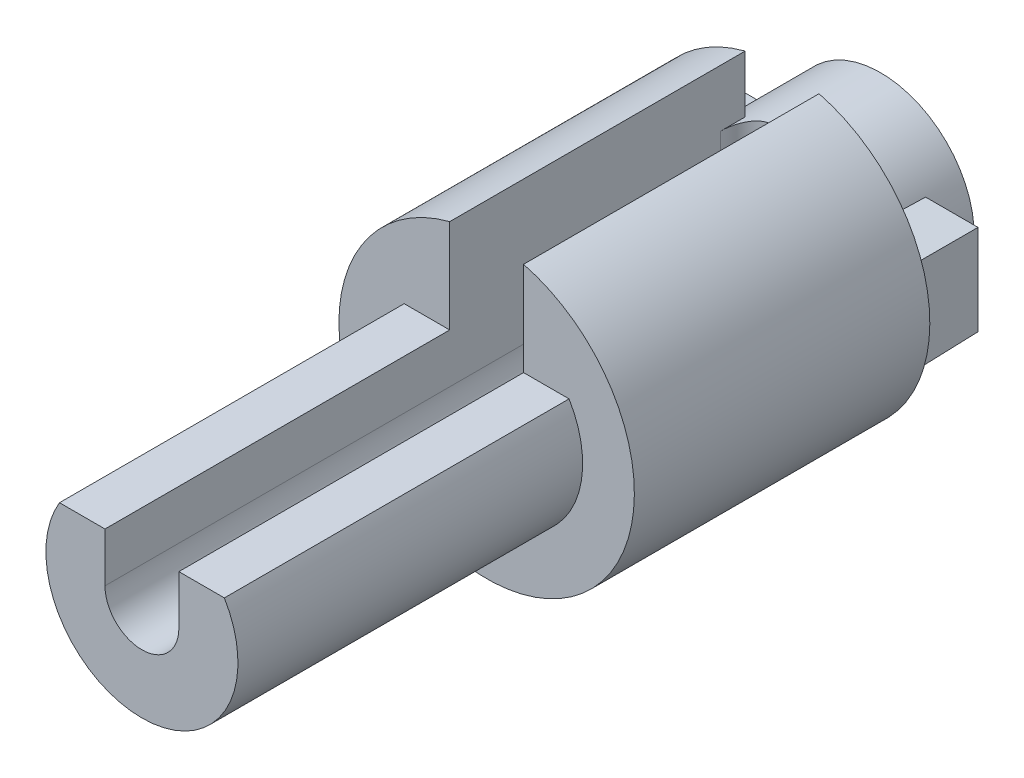
ISO-10303-21;
HEADER;
FILE_DESCRIPTION(('STEP AP214'),'2;1');
FILE_NAME('part.step','',(''),(''),'','','');
FILE_SCHEMA(('AUTOMOTIVE_DESIGN { 1 0 10303 214 1 1 1 1 }'));
ENDSEC;
DATA;
#1=APPLICATION_CONTEXT('core data for automotive mechanical design processes');
#2=APPLICATION_PROTOCOL_DEFINITION('international standard','automotive_design',2000,#1);
#3=PRODUCT_CONTEXT('',#1,'mechanical');
#4=PRODUCT('Part','Part','',(#3));
#5=PRODUCT_RELATED_PRODUCT_CATEGORY('part','',(#4));
#6=PRODUCT_DEFINITION_FORMATION('','',#4);
#7=PRODUCT_DEFINITION_CONTEXT('part definition',#1,'design');
#8=PRODUCT_DEFINITION('design','',#6,#7);
#9=PRODUCT_DEFINITION_SHAPE('','',#8);
#10=(LENGTH_UNIT() NAMED_UNIT(*) SI_UNIT(.MILLI.,.METRE.));
#11=(NAMED_UNIT(*) PLANE_ANGLE_UNIT() SI_UNIT($,.RADIAN.));
#12=(NAMED_UNIT(*) SI_UNIT($,.STERADIAN.) SOLID_ANGLE_UNIT());
#13=UNCERTAINTY_MEASURE_WITH_UNIT(LENGTH_MEASURE(1.E-05),#10,'distance_accuracy_value','');
#14=(GEOMETRIC_REPRESENTATION_CONTEXT(3) GLOBAL_UNCERTAINTY_ASSIGNED_CONTEXT((#13)) GLOBAL_UNIT_ASSIGNED_CONTEXT((#10,
#11,#12)) REPRESENTATION_CONTEXT('',''));
#15=CARTESIAN_POINT('',(0.,0.,0.));
#16=DIRECTION('',(0.,0.,1.));
#17=DIRECTION('',(1.,0.,0.));
#18=AXIS2_PLACEMENT_3D('',#15,#16,#17);
#19=CARTESIAN_POINT('',(-8.49971958286482,10.862396022545,0.));
#20=DIRECTION('',(0.,0.,1.));
#21=DIRECTION('',(1.,0.,0.));
#22=AXIS2_PLACEMENT_3D('',#19,#20,#21);
#23=PLANE('',#22);
#24=CARTESIAN_POINT('',(0.,0.,0.));
#25=DIRECTION('',(0.,0.,-1.));
#26=DIRECTION('',(-1.,0.,0.));
#27=AXIS2_PLACEMENT_3D('',#24,#25,#26);
#28=CIRCLE('',#27,3.);
#29=CARTESIAN_POINT('',(0.75,2.90473750965557,0.));
#30=VERTEX_POINT('',#29);
#31=CARTESIAN_POINT('',(-0.749999999999993,2.90473750965557,0.));
#32=VERTEX_POINT('',#31);
#33=EDGE_CURVE('E217',#30,#32,#28,.T.);
#34=ORIENTED_EDGE('',*,*,#33,.T.);
#35=DIRECTION('',(0.,1.,0.));
#36=VECTOR('',#35,1.);
#37=CARTESIAN_POINT('',(-0.750000000000003,0.,0.));
#38=LINE('',#37,#36);
#39=CARTESIAN_POINT('',(-0.749999999999997,1.74570902500961,0.));
#40=VERTEX_POINT('',#39);
#41=EDGE_CURVE('E278',#40,#32,#38,.T.);
#42=ORIENTED_EDGE('',*,*,#41,.F.);
#43=CARTESIAN_POINT('',(0.,0.,0.));
#44=DIRECTION('',(0.,0.,-1.));
#45=DIRECTION('',(-1.,0.,0.));
#46=AXIS2_PLACEMENT_3D('',#43,#44,#45);
#47=CIRCLE('',#46,1.9);
#48=CARTESIAN_POINT('',(-1.65118139524402,0.940000000000002,0.));
#49=VERTEX_POINT('',#48);
#50=EDGE_CURVE('E230',#49,#40,#47,.T.);
#51=ORIENTED_EDGE('',*,*,#50,.F.);
#52=DIRECTION('',(1.,0.,0.));
#53=VECTOR('',#52,1.);
#54=CARTESIAN_POINT('',(2.75,0.940000000000002,0.));
#55=LINE('',#54,#53);
#56=CARTESIAN_POINT('',(-2.75,0.940000000000002,0.));
#57=VERTEX_POINT('',#56);
#58=EDGE_CURVE('E242',#57,#49,#55,.T.);
#59=ORIENTED_EDGE('',*,*,#58,.F.);
#60=DIRECTION('',(0.,1.,0.));
#61=VECTOR('',#60,1.);
#62=CARTESIAN_POINT('',(-2.75,0.940000000000002,0.));
#63=LINE('',#62,#61);
#64=CARTESIAN_POINT('',(-2.75,-0.939999999999998,0.));
#65=VERTEX_POINT('',#64);
#66=EDGE_CURVE('E239',#65,#57,#63,.T.);
#67=ORIENTED_EDGE('',*,*,#66,.F.);
#68=DIRECTION('',(-1.,0.,0.));
#69=VECTOR('',#68,1.);
#70=CARTESIAN_POINT('',(2.75,-0.939999999999998,0.));
#71=LINE('',#70,#69);
#72=CARTESIAN_POINT('',(-1.65118139524402,-0.939999999999998,0.));
#73=VERTEX_POINT('',#72);
#74=EDGE_CURVE('E248',#73,#65,#71,.T.);
#75=ORIENTED_EDGE('',*,*,#74,.F.);
#76=CARTESIAN_POINT('',(1.65118139524402,-0.939999999999998,0.));
#77=VERTEX_POINT('',#76);
#78=EDGE_CURVE('E225',#77,#73,#47,.T.);
#79=ORIENTED_EDGE('',*,*,#78,.F.);
#80=CARTESIAN_POINT('',(2.75,-0.939999999999998,0.));
#81=VERTEX_POINT('',#80);
#82=EDGE_CURVE('E249',#81,#77,#71,.T.);
#83=ORIENTED_EDGE('',*,*,#82,.F.);
#84=DIRECTION('',(0.,-1.,0.));
#85=VECTOR('',#84,1.);
#86=CARTESIAN_POINT('',(2.75,0.940000000000002,0.));
#87=LINE('',#86,#85);
#88=CARTESIAN_POINT('',(2.75,0.940000000000002,0.));
#89=VERTEX_POINT('',#88);
#90=EDGE_CURVE('E245',#89,#81,#87,.T.);
#91=ORIENTED_EDGE('',*,*,#90,.F.);
#92=CARTESIAN_POINT('',(1.65118139524402,0.940000000000002,0.));
#93=VERTEX_POINT('',#92);
#94=EDGE_CURVE('E190',#93,#89,#55,.T.);
#95=ORIENTED_EDGE('',*,*,#94,.F.);
#96=CARTESIAN_POINT('',(0.749999999999997,1.74570902500961,0.));
#97=VERTEX_POINT('',#96);
#98=EDGE_CURVE('E233',#97,#93,#47,.T.);
#99=ORIENTED_EDGE('',*,*,#98,.F.);
#100=DIRECTION('',(0.,-1.,0.));
#101=VECTOR('',#100,1.);
#102=CARTESIAN_POINT('',(0.75,0.,0.));
#103=LINE('',#102,#101);
#104=EDGE_CURVE('E281',#30,#97,#103,.T.);
#105=ORIENTED_EDGE('',*,*,#104,.F.);
#106=EDGE_LOOP('',(#34,#42,#51,#59,#67,#75,#79,#83,#91,#95,#99,#105));
#107=FACE_BOUND('',#106,.T.);
#108=ADVANCED_FACE('F41',(#107),#23,.F.);
#109=CARTESIAN_POINT('',(-0.750000000000003,0.,11.));
#110=DIRECTION('',(-1.,0.,0.));
#111=DIRECTION('',(0.,-1.,0.));
#112=AXIS2_PLACEMENT_3D('',#109,#110,#111);
#113=PLANE('',#112);
#114=DIRECTION('',(0.,0.,-1.));
#115=VECTOR('',#114,1.);
#116=CARTESIAN_POINT('',(-0.750000000000003,0.,11.));
#117=LINE('',#116,#115);
#118=CARTESIAN_POINT('',(-0.750000000000004,0.,13.));
#119=VERTEX_POINT('',#118);
#120=CARTESIAN_POINT('',(-0.750000000000003,0.,0.5));
#121=VERTEX_POINT('',#120);
#122=EDGE_CURVE('E297',#119,#121,#117,.T.);
#123=ORIENTED_EDGE('',*,*,#122,.T.);
#124=DIRECTION('',(0.,1.,0.));
#125=VECTOR('',#124,1.);
#126=CARTESIAN_POINT('',(-0.749999999999997,1.74570902500961,0.5));
#127=LINE('',#126,#125);
#128=CARTESIAN_POINT('',(-0.749999999999997,1.74570902500961,0.5));
#129=VERTEX_POINT('',#128);
#130=EDGE_CURVE('E321',#121,#129,#127,.T.);
#131=ORIENTED_EDGE('',*,*,#130,.T.);
#132=DIRECTION('',(0.,0.,1.));
#133=VECTOR('',#132,1.);
#134=CARTESIAN_POINT('',(-0.749999999999997,1.74570902500961,0.5));
#135=LINE('',#134,#133);
#136=EDGE_CURVE('E65',#129,#40,#135,.F.);
#137=ORIENTED_EDGE('',*,*,#136,.T.);
#138=ORIENTED_EDGE('',*,*,#41,.T.);
#139=DIRECTION('',(0.,0.,-1.));
#140=VECTOR('',#139,1.);
#141=CARTESIAN_POINT('',(-0.749999999999993,2.90473750965557,25.));
#142=LINE('',#141,#140);
#143=CARTESIAN_POINT('',(-0.750000000000002,2.90473750965556,6.));
#144=VERTEX_POINT('',#143);
#145=EDGE_CURVE('E223',#144,#32,#142,.T.);
#146=ORIENTED_EDGE('',*,*,#145,.F.);
#147=DIRECTION('',(0.,-1.,0.));
#148=VECTOR('',#147,1.);
#149=CARTESIAN_POINT('',(-0.750000000000003,0.,6.));
#150=LINE('',#149,#148);
#151=CARTESIAN_POINT('',(-0.750000000000003,1.,6.));
#152=VERTEX_POINT('',#151);
#153=EDGE_CURVE('E282',#144,#152,#150,.T.);
#154=ORIENTED_EDGE('',*,*,#153,.T.);
#155=DIRECTION('',(0.,0.,-1.));
#156=VECTOR('',#155,1.);
#157=CARTESIAN_POINT('',(-0.749999999999999,1.,11.));
#158=LINE('',#157,#156);
#159=CARTESIAN_POINT('',(-0.749999999999999,1.,13.));
#160=VERTEX_POINT('',#159);
#161=EDGE_CURVE('E294',#160,#152,#158,.T.);
#162=ORIENTED_EDGE('',*,*,#161,.F.);
#163=DIRECTION('',(0.,1.,0.));
#164=VECTOR('',#163,1.);
#165=CARTESIAN_POINT('',(-0.750000000000004,0.,13.));
#166=LINE('',#165,#164);
#167=EDGE_CURVE('E213',#119,#160,#166,.T.);
#168=ORIENTED_EDGE('',*,*,#167,.F.);
#169=EDGE_LOOP('',(#123,#131,#137,#138,#146,#154,#162,#168));
#170=FACE_BOUND('',#169,.T.);
#171=ADVANCED_FACE('F353',(#170),#113,.F.);
#172=CARTESIAN_POINT('',(0.,0.,6.));
#173=DIRECTION('',(0.,0.,1.));
#174=DIRECTION('',(1.,0.,0.));
#175=AXIS2_PLACEMENT_3D('',#172,#173,#174);
#176=PLANE('',#175);
#177=ORIENTED_EDGE('',*,*,#153,.F.);
#178=CARTESIAN_POINT('',(0.,0.,6.));
#179=DIRECTION('',(0.,0.,1.));
#180=DIRECTION('',(1.,0.,0.));
#181=AXIS2_PLACEMENT_3D('',#178,#179,#180);
#182=CIRCLE('',#181,3.);
#183=CARTESIAN_POINT('',(0.749999999999993,2.90473750965557,6.));
#184=VERTEX_POINT('',#183);
#185=EDGE_CURVE('E220',#144,#184,#182,.T.);
#186=ORIENTED_EDGE('',*,*,#185,.T.);
#187=DIRECTION('',(0.,1.,0.));
#188=VECTOR('',#187,1.);
#189=CARTESIAN_POINT('',(0.75,0.,6.));
#190=LINE('',#189,#188);
#191=CARTESIAN_POINT('',(0.75,1.,6.));
#192=VERTEX_POINT('',#191);
#193=EDGE_CURVE('E256',#192,#184,#190,.T.);
#194=ORIENTED_EDGE('',*,*,#193,.F.);
#195=DIRECTION('',(-1.,0.,0.));
#196=VECTOR('',#195,1.);
#197=CARTESIAN_POINT('',(0.749999999999999,1.,6.));
#198=LINE('',#197,#196);
#199=CARTESIAN_POINT('',(1.67406690427832,1.,6.));
#200=VERTEX_POINT('',#199);
#201=EDGE_CURVE('E288',#200,#192,#198,.T.);
#202=ORIENTED_EDGE('',*,*,#201,.F.);
#203=CARTESIAN_POINT('',(0.,0.,6.));
#204=DIRECTION('',(0.,0.,1.));
#205=DIRECTION('',(1.,0.,0.));
#206=AXIS2_PLACEMENT_3D('',#203,#204,#205);
#207=CIRCLE('',#206,1.95);
#208=CARTESIAN_POINT('',(-1.67406690427832,1.,6.));
#209=VERTEX_POINT('',#208);
#210=EDGE_CURVE('E186',#209,#200,#207,.T.);
#211=ORIENTED_EDGE('',*,*,#210,.F.);
#212=DIRECTION('',(-1.,0.,0.));
#213=VECTOR('',#212,1.);
#214=CARTESIAN_POINT('',(-1.67406690427832,1.,6.));
#215=LINE('',#214,#213);
#216=EDGE_CURVE('E290',#152,#209,#215,.T.);
#217=ORIENTED_EDGE('',*,*,#216,.F.);
#218=EDGE_LOOP('',(#177,#186,#194,#202,#211,#217));
#219=FACE_BOUND('',#218,.T.);
#220=ADVANCED_FACE('F358',(#219),#176,.T.);
#221=CARTESIAN_POINT('',(0.750000000000003,0.,11.));
#222=DIRECTION('',(1.,0.,0.));
#223=DIRECTION('',(0.,1.,0.));
#224=AXIS2_PLACEMENT_3D('',#221,#222,#223);
#225=PLANE('',#224);
#226=DIRECTION('',(0.,0.,1.));
#227=VECTOR('',#226,1.);
#228=CARTESIAN_POINT('',(0.749999999999997,1.74570902500961,0.));
#229=LINE('',#228,#227);
#230=CARTESIAN_POINT('',(0.749999999999997,1.74570902500961,0.5));
#231=VERTEX_POINT('',#230);
#232=EDGE_CURVE('E59',#97,#231,#229,.T.);
#233=ORIENTED_EDGE('',*,*,#232,.T.);
#234=DIRECTION('',(0.,-1.,0.));
#235=VECTOR('',#234,1.);
#236=CARTESIAN_POINT('',(0.750000000000003,0.,0.5));
#237=LINE('',#236,#235);
#238=CARTESIAN_POINT('',(0.75,0.,0.5));
#239=VERTEX_POINT('',#238);
#240=EDGE_CURVE('E311',#231,#239,#237,.T.);
#241=ORIENTED_EDGE('',*,*,#240,.T.);
#242=DIRECTION('',(0.,0.,-1.));
#243=VECTOR('',#242,1.);
#244=CARTESIAN_POINT('',(0.75,0.,11.));
#245=LINE('',#244,#243);
#246=CARTESIAN_POINT('',(0.749999999999999,0.,13.));
#247=VERTEX_POINT('',#246);
#248=EDGE_CURVE('E300',#247,#239,#245,.T.);
#249=ORIENTED_EDGE('',*,*,#248,.F.);
#250=DIRECTION('',(0.,-1.,0.));
#251=VECTOR('',#250,1.);
#252=CARTESIAN_POINT('',(0.749999999999999,1.,13.));
#253=LINE('',#252,#251);
#254=CARTESIAN_POINT('',(0.749999999999999,1.,13.));
#255=VERTEX_POINT('',#254);
#256=EDGE_CURVE('E200',#255,#247,#253,.T.);
#257=ORIENTED_EDGE('',*,*,#256,.F.);
#258=DIRECTION('',(0.,0.,-1.));
#259=VECTOR('',#258,1.);
#260=CARTESIAN_POINT('',(0.749999999999999,1.,11.));
#261=LINE('',#260,#259);
#262=EDGE_CURVE('E191',#255,#192,#261,.T.);
#263=ORIENTED_EDGE('',*,*,#262,.T.);
#264=ORIENTED_EDGE('',*,*,#193,.T.);
#265=DIRECTION('',(0.,0.,-1.));
#266=VECTOR('',#265,1.);
#267=CARTESIAN_POINT('',(0.749999999999993,2.90473750965557,25.));
#268=LINE('',#267,#266);
#269=EDGE_CURVE('E308',#30,#184,#268,.F.);
#270=ORIENTED_EDGE('',*,*,#269,.F.);
#271=ORIENTED_EDGE('',*,*,#104,.T.);
#272=EDGE_LOOP('',(#233,#241,#249,#257,#263,#264,#270,#271));
#273=FACE_BOUND('',#272,.T.);
#274=ADVANCED_FACE('F422',(#273),#225,.F.);
#275=CARTESIAN_POINT('',(2.75,0.940000000000002,0.));
#276=DIRECTION('',(0.,0.999847695156391,-0.0174524064372835));
#277=DIRECTION('',(0.,0.0174524064372835,0.999847695156391));
#278=AXIS2_PLACEMENT_3D('',#275,#276,#277);
#279=PLANE('',#278);
#280=CARTESIAN_POINT('',(0.,0.,-53.8525639329138));
#281=DIRECTION('',(0.,0.999847695156391,-0.0174524064372835));
#282=DIRECTION('',(0.,0.0174524064372835,0.999847695156391));
#283=AXIS2_PLACEMENT_3D('',#280,#281,#282);
#284=ELLIPSE('',#283,108.867508147245,1.9);
#285=CARTESIAN_POINT('',(1.66341316009827,0.91818116883973,-1.25));
#286=VERTEX_POINT('',#285);
#287=EDGE_CURVE('E238',#93,#286,#284,.T.);
#288=ORIENTED_EDGE('',*,*,#287,.F.);
#289=ORIENTED_EDGE('',*,*,#94,.T.);
#290=DIRECTION('',(0.0174497491606827,0.0174497491606827,0.999695459881887));
#291=VECTOR('',#290,1.);
#292=CARTESIAN_POINT('',(2.75,0.940000000000002,0.));
#293=LINE('',#292,#291);
#294=CARTESIAN_POINT('',(2.72818116883973,0.91818116883973,-1.25));
#295=VERTEX_POINT('',#294);
#296=EDGE_CURVE('E257',#295,#89,#293,.T.);
#297=ORIENTED_EDGE('',*,*,#296,.F.);
#298=DIRECTION('',(-1.,0.,0.));
#299=VECTOR('',#298,1.);
#300=CARTESIAN_POINT('',(2.75,0.91818116883973,-1.25));
#301=LINE('',#300,#299);
#302=EDGE_CURVE('E269',#286,#295,#301,.F.);
#303=ORIENTED_EDGE('',*,*,#302,.F.);
#304=EDGE_LOOP('',(#288,#289,#297,#303));
#305=FACE_BOUND('',#304,.T.);
#306=ADVANCED_FACE('F428',(#305),#279,.T.);
#307=CARTESIAN_POINT('',(-1.66341316009827,0.91818116883973,-1.25));
#308=VERTEX_POINT('',#307);
#309=EDGE_CURVE('E235',#308,#49,#284,.T.);
#310=ORIENTED_EDGE('',*,*,#309,.F.);
#311=CARTESIAN_POINT('',(-2.72818116883973,0.91818116883973,-1.25));
#312=VERTEX_POINT('',#311);
#313=EDGE_CURVE('E270',#312,#308,#301,.F.);
#314=ORIENTED_EDGE('',*,*,#313,.F.);
#315=DIRECTION('',(-0.0174497491606827,0.0174497491606827,0.999695459881887));
#316=VECTOR('',#315,1.);
#317=CARTESIAN_POINT('',(-2.74832528439826,0.938325284398262,-0.0959443925660676));
#318=LINE('',#317,#316);
#319=EDGE_CURVE('E253',#312,#57,#318,.T.);
#320=ORIENTED_EDGE('',*,*,#319,.T.);
#321=ORIENTED_EDGE('',*,*,#58,.T.);
#322=EDGE_LOOP('',(#310,#314,#320,#321));
#323=FACE_BOUND('',#322,.T.);
#324=ADVANCED_FACE('F374',(#323),#279,.T.);
#325=CARTESIAN_POINT('',(2.75,-0.939999999999998,0.));
#326=DIRECTION('',(0.,-0.999847695156391,-0.0174524064372835));
#327=DIRECTION('',(0.,0.0174524064372835,-0.999847695156391));
#328=AXIS2_PLACEMENT_3D('',#325,#326,#327);
#329=PLANE('',#328);
#330=CARTESIAN_POINT('',(0.,0.,-53.8525639329137));
#331=DIRECTION('',(0.,-0.999847695156391,-0.0174524064372835));
#332=DIRECTION('',(0.,-0.0174524064372835,0.999847695156391));
#333=AXIS2_PLACEMENT_3D('',#330,#331,#332);
#334=ELLIPSE('',#333,108.867508147245,1.9);
#335=CARTESIAN_POINT('',(-1.66341316009827,-0.918181168839726,-1.25));
#336=VERTEX_POINT('',#335);
#337=EDGE_CURVE('E229',#73,#336,#334,.T.);
#338=ORIENTED_EDGE('',*,*,#337,.F.);
#339=ORIENTED_EDGE('',*,*,#74,.T.);
#340=DIRECTION('',(-0.0174497491606827,-0.0174497491606827,0.999695459881887));
#341=VECTOR('',#340,1.);
#342=CARTESIAN_POINT('',(-2.74942755175795,-0.939427551757949,-0.0327955378225831));
#343=LINE('',#342,#341);
#344=CARTESIAN_POINT('',(-2.72818116883973,-0.918181168839726,-1.25));
#345=VERTEX_POINT('',#344);
#346=EDGE_CURVE('E258',#345,#65,#343,.T.);
#347=ORIENTED_EDGE('',*,*,#346,.F.);
#348=DIRECTION('',(1.,0.,0.));
#349=VECTOR('',#348,1.);
#350=CARTESIAN_POINT('',(2.75,-0.918181168839726,-1.25));
#351=LINE('',#350,#349);
#352=EDGE_CURVE('E275',#336,#345,#351,.F.);
#353=ORIENTED_EDGE('',*,*,#352,.F.);
#354=EDGE_LOOP('',(#338,#339,#347,#353));
#355=FACE_BOUND('',#354,.T.);
#356=ADVANCED_FACE('F384',(#355),#329,.T.);
#357=CARTESIAN_POINT('',(1.66341316009827,-0.918181168839726,-1.25));
#358=VERTEX_POINT('',#357);
#359=EDGE_CURVE('E236',#358,#77,#334,.T.);
#360=ORIENTED_EDGE('',*,*,#359,.F.);
#361=CARTESIAN_POINT('',(2.72818116883973,-0.918181168839726,-1.25));
#362=VERTEX_POINT('',#361);
#363=EDGE_CURVE('E262',#362,#358,#351,.F.);
#364=ORIENTED_EDGE('',*,*,#363,.F.);
#365=DIRECTION('',(0.0174497491606827,-0.0174497491606827,0.999695459881887));
#366=VECTOR('',#365,1.);
#367=CARTESIAN_POINT('',(2.75,-0.939999999999998,0.));
#368=LINE('',#367,#366);
#369=EDGE_CURVE('E261',#362,#81,#368,.T.);
#370=ORIENTED_EDGE('',*,*,#369,.T.);
#371=ORIENTED_EDGE('',*,*,#82,.T.);
#372=EDGE_LOOP('',(#360,#364,#370,#371));
#373=FACE_BOUND('',#372,.T.);
#374=ADVANCED_FACE('F401',(#373),#329,.T.);
#375=CARTESIAN_POINT('',(0.,0.,-1.25));
#376=DIRECTION('',(0.,0.,-1.));
#377=DIRECTION('',(-1.,0.,0.));
#378=AXIS2_PLACEMENT_3D('',#375,#376,#377);
#379=PLANE('',#378);
#380=ORIENTED_EDGE('',*,*,#363,.T.);
#381=CARTESIAN_POINT('',(0.,0.,-1.25));
#382=DIRECTION('',(0.,0.,-1.));
#383=DIRECTION('',(-1.,0.,0.));
#384=AXIS2_PLACEMENT_3D('',#381,#382,#383);
#385=CIRCLE('',#384,1.9);
#386=EDGE_CURVE('E307',#358,#286,#385,.F.);
#387=ORIENTED_EDGE('',*,*,#386,.T.);
#388=ORIENTED_EDGE('',*,*,#302,.T.);
#389=DIRECTION('',(0.,1.,0.));
#390=VECTOR('',#389,1.);
#391=CARTESIAN_POINT('',(2.72818116883973,0.940000000000002,-1.25));
#392=LINE('',#391,#390);
#393=EDGE_CURVE('E273',#295,#362,#392,.F.);
#394=ORIENTED_EDGE('',*,*,#393,.T.);
#395=EDGE_LOOP('',(#380,#387,#388,#394));
#396=FACE_BOUND('',#395,.T.);
#397=ADVANCED_FACE('F391',(#396),#379,.T.);
#398=CARTESIAN_POINT('',(0.,0.,11.));
#399=DIRECTION('',(0.,0.,-1.));
#400=DIRECTION('',(-1.,0.,0.));
#401=AXIS2_PLACEMENT_3D('',#398,#399,#400);
#402=CYLINDRICAL_SURFACE('',#401,1.95);
#403=ORIENTED_EDGE('',*,*,#210,.T.);
#404=DIRECTION('',(0.,0.,-1.));
#405=VECTOR('',#404,1.);
#406=CARTESIAN_POINT('',(1.67406690427832,1.,11.));
#407=LINE('',#406,#405);
#408=CARTESIAN_POINT('',(1.67406690427832,1.,13.));
#409=VERTEX_POINT('',#408);
#410=EDGE_CURVE('E179',#409,#200,#407,.T.);
#411=ORIENTED_EDGE('',*,*,#410,.F.);
#412=CARTESIAN_POINT('',(0.,0.,13.));
#413=DIRECTION('',(0.,0.,1.));
#414=DIRECTION('',(1.,0.,0.));
#415=AXIS2_PLACEMENT_3D('',#412,#413,#414);
#416=CIRCLE('',#415,1.95);
#417=CARTESIAN_POINT('',(-1.67406690427832,1.,13.));
#418=VERTEX_POINT('',#417);
#419=EDGE_CURVE('E184',#418,#409,#416,.T.);
#420=ORIENTED_EDGE('',*,*,#419,.F.);
#421=DIRECTION('',(0.,0.,-1.));
#422=VECTOR('',#421,1.);
#423=CARTESIAN_POINT('',(-1.67406690427832,1.,11.));
#424=LINE('',#423,#422);
#425=EDGE_CURVE('E292',#418,#209,#424,.T.);
#426=ORIENTED_EDGE('',*,*,#425,.T.);
#427=EDGE_LOOP('',(#403,#411,#420,#426));
#428=FACE_BOUND('',#427,.T.);
#429=ADVANCED_FACE('F181',(#428),#402,.T.);
#430=CARTESIAN_POINT('',(-1.67406690427832,1.,11.));
#431=DIRECTION('',(0.,-1.,0.));
#432=DIRECTION('',(0.,0.,-1.));
#433=AXIS2_PLACEMENT_3D('',#430,#431,#432);
#434=PLANE('',#433);
#435=ORIENTED_EDGE('',*,*,#216,.T.);
#436=ORIENTED_EDGE('',*,*,#425,.F.);
#437=DIRECTION('',(-1.,0.,0.));
#438=VECTOR('',#437,1.);
#439=CARTESIAN_POINT('',(-0.749999999999999,1.,13.));
#440=LINE('',#439,#438);
#441=EDGE_CURVE('E206',#160,#418,#440,.T.);
#442=ORIENTED_EDGE('',*,*,#441,.F.);
#443=ORIENTED_EDGE('',*,*,#161,.T.);
#444=EDGE_LOOP('',(#435,#436,#442,#443));
#445=FACE_BOUND('',#444,.T.);
#446=ADVANCED_FACE('F407',(#445),#434,.F.);
#447=CARTESIAN_POINT('',(0.,0.,11.));
#448=DIRECTION('',(0.,0.,-1.));
#449=DIRECTION('',(-1.,0.,0.));
#450=AXIS2_PLACEMENT_3D('',#447,#448,#449);
#451=CYLINDRICAL_SURFACE('',#450,0.750000000000003);
#452=ORIENTED_EDGE('',*,*,#248,.T.);
#453=CARTESIAN_POINT('',(0.,0.,0.5));
#454=DIRECTION('',(0.,0.,-1.));
#455=DIRECTION('',(-1.,0.,0.));
#456=AXIS2_PLACEMENT_3D('',#453,#454,#455);
#457=CIRCLE('',#456,0.750000000000003);
#458=EDGE_CURVE('E323',#239,#121,#457,.T.);
#459=ORIENTED_EDGE('',*,*,#458,.T.);
#460=ORIENTED_EDGE('',*,*,#122,.F.);
#461=CARTESIAN_POINT('',(0.,0.,13.));
#462=DIRECTION('',(0.,0.,-1.));
#463=DIRECTION('',(1.,0.,0.));
#464=AXIS2_PLACEMENT_3D('',#461,#462,#463);
#465=CIRCLE('',#464,0.750000000000002);
#466=EDGE_CURVE('E210',#247,#119,#465,.T.);
#467=ORIENTED_EDGE('',*,*,#466,.F.);
#468=EDGE_LOOP('',(#452,#459,#460,#467));
#469=FACE_BOUND('',#468,.T.);
#470=ADVANCED_FACE('F412',(#469),#451,.F.);
#471=CARTESIAN_POINT('',(0.749999999999999,1.,11.));
#472=DIRECTION('',(0.,-1.,0.));
#473=DIRECTION('',(0.,0.,-1.));
#474=AXIS2_PLACEMENT_3D('',#471,#472,#473);
#475=PLANE('',#474);
#476=ORIENTED_EDGE('',*,*,#201,.T.);
#477=ORIENTED_EDGE('',*,*,#262,.F.);
#478=DIRECTION('',(-1.,0.,0.));
#479=VECTOR('',#478,1.);
#480=CARTESIAN_POINT('',(1.67406690427832,1.,13.));
#481=LINE('',#480,#479);
#482=EDGE_CURVE('E194',#409,#255,#481,.T.);
#483=ORIENTED_EDGE('',*,*,#482,.F.);
#484=ORIENTED_EDGE('',*,*,#410,.T.);
#485=EDGE_LOOP('',(#476,#477,#483,#484));
#486=FACE_BOUND('',#485,.T.);
#487=ADVANCED_FACE('F195',(#486),#475,.F.);
#488=CARTESIAN_POINT('',(-2.75,0.940000000000002,0.));
#489=DIRECTION('',(-0.999847695156391,0.,-0.0174524064372835));
#490=DIRECTION('',(-0.0174524064372835,0.,0.999847695156391));
#491=AXIS2_PLACEMENT_3D('',#488,#489,#490);
#492=PLANE('',#491);
#493=ORIENTED_EDGE('',*,*,#66,.T.);
#494=ORIENTED_EDGE('',*,*,#319,.F.);
#495=DIRECTION('',(0.,-1.,0.));
#496=VECTOR('',#495,1.);
#497=CARTESIAN_POINT('',(-2.72818116883973,0.940000000000002,-1.25));
#498=LINE('',#497,#496);
#499=EDGE_CURVE('E252',#345,#312,#498,.F.);
#500=ORIENTED_EDGE('',*,*,#499,.F.);
#501=ORIENTED_EDGE('',*,*,#346,.T.);
#502=EDGE_LOOP('',(#493,#494,#500,#501));
#503=FACE_BOUND('',#502,.T.);
#504=ADVANCED_FACE('F378',(#503),#492,.T.);
#505=CARTESIAN_POINT('',(2.75,0.940000000000002,0.));
#506=DIRECTION('',(0.999847695156391,0.,-0.0174524064372835));
#507=DIRECTION('',(-0.0174524064372835,0.,-0.999847695156391));
#508=AXIS2_PLACEMENT_3D('',#505,#506,#507);
#509=PLANE('',#508);
#510=ORIENTED_EDGE('',*,*,#90,.T.);
#511=ORIENTED_EDGE('',*,*,#369,.F.);
#512=ORIENTED_EDGE('',*,*,#393,.F.);
#513=ORIENTED_EDGE('',*,*,#296,.T.);
#514=EDGE_LOOP('',(#510,#511,#512,#513));
#515=FACE_BOUND('',#514,.T.);
#516=ADVANCED_FACE('F390',(#515),#509,.T.);
#517=ORIENTED_EDGE('',*,*,#313,.T.);
#518=EDGE_CURVE('E304',#308,#336,#385,.F.);
#519=ORIENTED_EDGE('',*,*,#518,.T.);
#520=ORIENTED_EDGE('',*,*,#352,.T.);
#521=ORIENTED_EDGE('',*,*,#499,.T.);
#522=EDGE_LOOP('',(#517,#519,#520,#521));
#523=FACE_BOUND('',#522,.T.);
#524=ADVANCED_FACE('F387',(#523),#379,.T.);
#525=CARTESIAN_POINT('',(0.,0.,0.));
#526=DIRECTION('',(0.,0.,-1.));
#527=DIRECTION('',(-1.,0.,0.));
#528=AXIS2_PLACEMENT_3D('',#525,#526,#527);
#529=PLANE('',#528);
#530=CARTESIAN_POINT('',(0.,0.,0.));
#531=DIRECTION('',(0.,0.,-1.));
#532=DIRECTION('',(-1.,0.,0.));
#533=AXIS2_PLACEMENT_3D('',#530,#531,#532);
#534=CIRCLE('',#533,0.250000000000003);
#535=CARTESIAN_POINT('',(-0.250000000000005,0.,0.));
#536=VERTEX_POINT('',#535);
#537=CARTESIAN_POINT('',(0.25,0.,0.));
#538=VERTEX_POINT('',#537);
#539=EDGE_CURVE('E314',#536,#538,#534,.F.);
#540=ORIENTED_EDGE('',*,*,#539,.T.);
#541=DIRECTION('',(0.,-1.,0.));
#542=VECTOR('',#541,1.);
#543=CARTESIAN_POINT('',(0.249999999999997,1.74570902500961,0.));
#544=LINE('',#543,#542);
#545=CARTESIAN_POINT('',(0.249999999999996,1.88348082018374,0.));
#546=VERTEX_POINT('',#545);
#547=EDGE_CURVE('E318',#538,#546,#544,.F.);
#548=ORIENTED_EDGE('',*,*,#547,.T.);
#549=CARTESIAN_POINT('',(-0.249999999999996,1.88348082018374,0.));
#550=VERTEX_POINT('',#549);
#551=EDGE_CURVE('E232',#550,#546,#47,.T.);
#552=ORIENTED_EDGE('',*,*,#551,.F.);
#553=DIRECTION('',(0.,1.,0.));
#554=VECTOR('',#553,1.);
#555=CARTESIAN_POINT('',(-0.250000000000003,0.,0.));
#556=LINE('',#555,#554);
#557=EDGE_CURVE('E316',#550,#536,#556,.F.);
#558=ORIENTED_EDGE('',*,*,#557,.T.);
#559=EDGE_LOOP('',(#540,#548,#552,#558));
#560=FACE_BOUND('',#559,.T.);
#561=ADVANCED_FACE('F389',(#560),#529,.F.);
#562=CARTESIAN_POINT('',(0.,0.,-2.));
#563=DIRECTION('',(0.,0.,1.));
#564=DIRECTION('',(1.,0.,0.));
#565=AXIS2_PLACEMENT_3D('',#562,#563,#564);
#566=CYLINDRICAL_SURFACE('',#565,1.9);
#567=CARTESIAN_POINT('',(0.,0.,-2.));
#568=DIRECTION('',(0.,0.,-1.));
#569=DIRECTION('',(-1.,0.,0.));
#570=AXIS2_PLACEMENT_3D('',#567,#568,#569);
#571=CIRCLE('',#570,1.9);
#572=CARTESIAN_POINT('',(-1.9,0.,-2.));
#573=VERTEX_POINT('',#572);
#574=EDGE_CURVE('E226',#573,#573,#571,.T.);
#575=ORIENTED_EDGE('',*,*,#574,.F.);
#576=EDGE_LOOP('',(#575));
#577=FACE_BOUND('',#576,.T.);
#578=ORIENTED_EDGE('',*,*,#98,.T.);
#579=ORIENTED_EDGE('',*,*,#287,.T.);
#580=ORIENTED_EDGE('',*,*,#386,.F.);
#581=ORIENTED_EDGE('',*,*,#359,.T.);
#582=ORIENTED_EDGE('',*,*,#78,.T.);
#583=ORIENTED_EDGE('',*,*,#337,.T.);
#584=ORIENTED_EDGE('',*,*,#518,.F.);
#585=ORIENTED_EDGE('',*,*,#309,.T.);
#586=ORIENTED_EDGE('',*,*,#50,.T.);
#587=ORIENTED_EDGE('',*,*,#136,.F.);
#588=CARTESIAN_POINT('',(-0.749999999999997,1.74570902500961,0.5));
#589=CARTESIAN_POINT('',(-0.750029233505753,1.74567879773989,0.47319297654147));
#590=CARTESIAN_POINT('',(-0.747846368383844,1.74663431555306,0.44641531809689));
#591=CARTESIAN_POINT('',(-0.73929839148195,1.75027865788535,0.393755730456624));
#592=CARTESIAN_POINT('',(-0.732948910791765,1.75296100348685,0.367870832589943));
#593=CARTESIAN_POINT('',(-0.716312912663148,1.75982139447935,0.317642304770965));
#594=CARTESIAN_POINT('',(-0.706029456432342,1.76399827673947,0.293297493528745));
#595=CARTESIAN_POINT('',(-0.681878272612024,1.77347428665004,0.246680914847342));
#596=CARTESIAN_POINT('',(-0.668007757745902,1.77877428642321,0.224410777892995));
#597=CARTESIAN_POINT('',(-0.63636155608914,1.79034621678016,0.181458385714698));
#598=CARTESIAN_POINT('',(-0.618436077851274,1.7966515498275,0.160895611408384));
#599=CARTESIAN_POINT('',(-0.579544501530781,1.8095712016588,0.122987700434886));
#600=CARTESIAN_POINT('',(-0.558577267523562,1.81618563524611,0.105643771364848));
#601=CARTESIAN_POINT('',(-0.512770216310375,1.8296635551202,0.0736464274255802));
#602=CARTESIAN_POINT('',(-0.487775221288481,1.8365188306421,0.0592110556304453));
#603=CARTESIAN_POINT('',(-0.435550909955913,1.84959956946737,0.0348115779455027));
#604=CARTESIAN_POINT('',(-0.408323365636536,1.85582552366954,0.0248439658290792));
#605=CARTESIAN_POINT('',(-0.359240660860567,1.86585354927694,0.0115897262968637));
#606=CARTESIAN_POINT('',(-0.33770608252359,1.86987556337722,0.00726400528744639));
#607=CARTESIAN_POINT('',(-0.294138095642854,1.87722637511979,0.00146554027037611));
#608=CARTESIAN_POINT('',(-0.272104607074313,1.88055506066688,-6.74272141766583E-06));
#609=CARTESIAN_POINT('',(-0.249999999999996,1.88348082018374,0.));
#610=B_SPLINE_CURVE_WITH_KNOTS('',3,(#588,#589,#590,#591,#592,#593,#594,#595,#596,#597,#598,
#599,#600,#601,#602,#603,#604,#605,#606,#607,#608,#609),.UNSPECIFIED.,.F.,.F.,(4,2,2,2,2,2,2,2,
2,2,4),(0.,0.0802693820611579,0.160239341360059,0.240147198511786,0.320117334556256,
0.40375101105699,0.487416000813814,0.575998285142791,0.664510929265537,0.731310428299347,
0.798120718898243),.UNSPECIFIED.);
#611=EDGE_CURVE('E13',#129,#550,#610,.T.);
#612=ORIENTED_EDGE('',*,*,#611,.T.);
#613=ORIENTED_EDGE('',*,*,#551,.T.);
#614=CARTESIAN_POINT('',(0.249999999999996,1.88348082018374,0.));
#615=CARTESIAN_POINT('',(0.278397243894079,1.87973513707114,-2.17218023920838E-05));
#616=CARTESIAN_POINT('',(0.306673074293827,1.87530582068588,0.00241696572982595));
#617=CARTESIAN_POINT('',(0.362163929038806,1.86537021326635,0.0119390291113938));
#618=CARTESIAN_POINT('',(0.389381485066964,1.85986670990933,0.0190104918249844));
#619=CARTESIAN_POINT('',(0.442072505018498,1.84805511403062,0.0375181255561559));
#620=CARTESIAN_POINT('',(0.467547174235623,1.84174758635434,0.0489512435416625));
#621=CARTESIAN_POINT('',(0.516180709809309,1.82871280042318,0.0758303068970644));
#622=CARTESIAN_POINT('',(0.539338184243379,1.82198529378295,0.0912786443763682));
#623=CARTESIAN_POINT('',(0.583488648341703,1.80833983002367,0.126361110309834));
#624=CARTESIAN_POINT('',(0.604387178567638,1.80142276593913,0.146114659019181));
#625=CARTESIAN_POINT('',(0.642578115750059,1.78815625645803,0.18902231070979));
#626=CARTESIAN_POINT('',(0.659869941225454,1.78180690268314,0.212176961000394));
#627=CARTESIAN_POINT('',(0.690280988127212,1.77024777954215,0.261283961998473));
#628=CARTESIAN_POINT('',(0.703407733607075,1.7650359606437,0.287231153175551));
#629=CARTESIAN_POINT('',(0.725012298414204,1.75627291632078,0.341236543300318));
#630=CARTESIAN_POINT('',(0.733497478780118,1.75271906286093,0.369291318990753));
#631=CARTESIAN_POINT('',(0.742963001612016,1.7487195293626,0.414672728031948));
#632=CARTESIAN_POINT('',(0.745596786601651,1.74759591888022,0.431611683435625));
#633=CARTESIAN_POINT('',(0.74911644085254,1.74608872190912,0.465696569954437));
#634=CARTESIAN_POINT('',(0.750002897913542,1.74570488656158,0.482842429513671));
#635=CARTESIAN_POINT('',(0.749999999999997,1.74570902500961,0.5));
#636=B_SPLINE_CURVE_WITH_KNOTS('',3,(#614,#615,#616,#617,#618,#619,#620,#621,#622,#623,#624,
#625,#626,#627,#628,#629,#630,#631,#632,#633,#634,#635),.UNSPECIFIED.,.F.,.F.,(4,2,2,2,2,2,2,2,
2,2,4),(0.,0.0857729793374474,0.171326255503183,0.256819756411875,0.342364308192298,
0.430680978210021,0.519011875853823,0.607182286557877,0.695212459770203,0.746653246841292,
0.798076726316634),.UNSPECIFIED.);
#637=EDGE_CURVE('E51',#546,#231,#636,.T.);
#638=ORIENTED_EDGE('',*,*,#637,.T.);
#639=ORIENTED_EDGE('',*,*,#232,.F.);
#640=EDGE_LOOP('',(#578,#579,#580,#581,#582,#583,#584,#585,#586,#587,#612,#613,#638,#639));
#641=FACE_BOUND('',#640,.T.);
#642=ADVANCED_FACE('F333',(#577,#641),#566,.T.);
#643=CARTESIAN_POINT('',(0.,0.,-2.));
#644=DIRECTION('',(0.,0.,-1.));
#645=DIRECTION('',(-1.,0.,0.));
#646=AXIS2_PLACEMENT_3D('',#643,#644,#645);
#647=PLANE('',#646);
#648=ORIENTED_EDGE('',*,*,#574,.T.);
#649=EDGE_LOOP('',(#648));
#650=FACE_BOUND('',#649,.T.);
#651=ADVANCED_FACE('F587',(#650),#647,.T.);
#652=CARTESIAN_POINT('',(0.,0.,25.));
#653=DIRECTION('',(0.,0.,-1.));
#654=DIRECTION('',(-1.,0.,0.));
#655=AXIS2_PLACEMENT_3D('',#652,#653,#654);
#656=CYLINDRICAL_SURFACE('',#655,3.);
#657=ORIENTED_EDGE('',*,*,#145,.T.);
#658=ORIENTED_EDGE('',*,*,#33,.F.);
#659=ORIENTED_EDGE('',*,*,#269,.T.);
#660=ORIENTED_EDGE('',*,*,#185,.F.);
#661=EDGE_LOOP('',(#657,#658,#659,#660));
#662=FACE_BOUND('',#661,.T.);
#663=ADVANCED_FACE('F349',(#662),#656,.T.);
#664=CARTESIAN_POINT('',(-0.250000000000003,0.,0.5));
#665=DIRECTION('',(0.,-1.,0.));
#666=DIRECTION('',(1.,0.,0.));
#667=AXIS2_PLACEMENT_3D('',#664,#665,#666);
#668=CYLINDRICAL_SURFACE('',#667,0.5);
#669=ORIENTED_EDGE('',*,*,#611,.F.);
#670=ORIENTED_EDGE('',*,*,#130,.F.);
#671=CARTESIAN_POINT('',(-0.250000000000003,0.,0.5));
#672=DIRECTION('',(0.,1.,0.));
#673=DIRECTION('',(-1.,0.,0.));
#674=AXIS2_PLACEMENT_3D('',#671,#672,#673);
#675=CIRCLE('',#674,0.5);
#676=EDGE_CURVE('E46',#536,#121,#675,.T.);
#677=ORIENTED_EDGE('',*,*,#676,.F.);
#678=ORIENTED_EDGE('',*,*,#557,.F.);
#679=EDGE_LOOP('',(#669,#670,#677,#678));
#680=FACE_BOUND('',#679,.T.);
#681=ADVANCED_FACE('F43',(#680),#668,.F.);
#682=CARTESIAN_POINT('',(0.,0.,0.5));
#683=DIRECTION('',(0.,0.,-1.));
#684=DIRECTION('',(-1.,0.,0.));
#685=AXIS2_PLACEMENT_3D('',#682,#683,#684);
#686=DEGENERATE_TOROIDAL_SURFACE('',#685,0.250000000000003,0.5,.T.);
#687=ORIENTED_EDGE('',*,*,#676,.T.);
#688=ORIENTED_EDGE('',*,*,#458,.F.);
#689=CARTESIAN_POINT('',(0.25,0.,0.5));
#690=DIRECTION('',(0.,-1.,0.));
#691=DIRECTION('',(1.,0.,0.));
#692=AXIS2_PLACEMENT_3D('',#689,#690,#691);
#693=CIRCLE('',#692,0.5);
#694=EDGE_CURVE('E216',#538,#239,#693,.T.);
#695=ORIENTED_EDGE('',*,*,#694,.F.);
#696=ORIENTED_EDGE('',*,*,#539,.F.);
#697=EDGE_LOOP('',(#687,#688,#695,#696));
#698=FACE_BOUND('',#697,.T.);
#699=ADVANCED_FACE('F341',(#698),#686,.F.);
#700=CARTESIAN_POINT('',(0.250000000000003,0.,0.5));
#701=DIRECTION('',(0.,1.,0.));
#702=DIRECTION('',(-1.,0.,0.));
#703=AXIS2_PLACEMENT_3D('',#700,#701,#702);
#704=CYLINDRICAL_SURFACE('',#703,0.5);
#705=ORIENTED_EDGE('',*,*,#637,.F.);
#706=ORIENTED_EDGE('',*,*,#547,.F.);
#707=ORIENTED_EDGE('',*,*,#694,.T.);
#708=ORIENTED_EDGE('',*,*,#240,.F.);
#709=EDGE_LOOP('',(#705,#706,#707,#708));
#710=FACE_BOUND('',#709,.T.);
#711=ADVANCED_FACE('F337',(#710),#704,.F.);
#712=CARTESIAN_POINT('',(0.,0.,13.));
#713=DIRECTION('',(0.,0.,1.));
#714=DIRECTION('',(1.,0.,0.));
#715=AXIS2_PLACEMENT_3D('',#712,#713,#714);
#716=PLANE('',#715);
#717=ORIENTED_EDGE('',*,*,#419,.T.);
#718=ORIENTED_EDGE('',*,*,#482,.T.);
#719=ORIENTED_EDGE('',*,*,#256,.T.);
#720=ORIENTED_EDGE('',*,*,#466,.T.);
#721=ORIENTED_EDGE('',*,*,#167,.T.);
#722=ORIENTED_EDGE('',*,*,#441,.T.);
#723=EDGE_LOOP('',(#717,#718,#719,#720,#721,#722));
#724=FACE_BOUND('',#723,.T.);
#725=ADVANCED_FACE('F203',(#724),#716,.T.);
#726=CLOSED_SHELL('',(#108,#171,#220,#274,#306,#324,#356,#374,#397,#429,#446,#470,#487,#504,
#516,#524,#561,#642,#651,#663,#681,#699,#711,#725));
#727=MANIFOLD_SOLID_BREP('B2',#726);
#728=ADVANCED_BREP_SHAPE_REPRESENTATION('',(#18,#727),#14);
#729=SHAPE_DEFINITION_REPRESENTATION(#9,#728);
ENDSEC;
END-ISO-10303-21;
